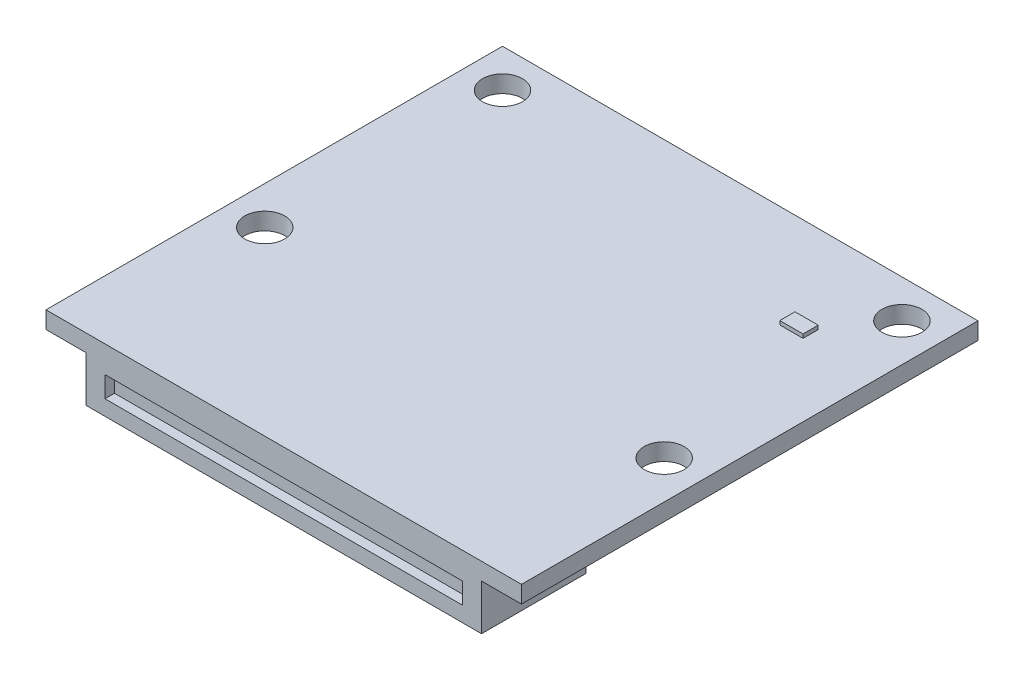
ISO-10303-21;
HEADER;
FILE_DESCRIPTION(('STEP AP214'),'2;1');
FILE_NAME('part.step','',(''),(''),'','','');
FILE_SCHEMA(('AUTOMOTIVE_DESIGN { 1 0 10303 214 1 1 1 1 }'));
ENDSEC;
DATA;
#1=APPLICATION_CONTEXT('core data for automotive mechanical design processes');
#2=APPLICATION_PROTOCOL_DEFINITION('international standard','automotive_design',2000,#1);
#3=PRODUCT_CONTEXT('',#1,'mechanical');
#4=PRODUCT('Part','Part','',(#3));
#5=PRODUCT_RELATED_PRODUCT_CATEGORY('part','',(#4));
#6=PRODUCT_DEFINITION_FORMATION('','',#4);
#7=PRODUCT_DEFINITION_CONTEXT('part definition',#1,'design');
#8=PRODUCT_DEFINITION('design','',#6,#7);
#9=PRODUCT_DEFINITION_SHAPE('','',#8);
#10=(LENGTH_UNIT() NAMED_UNIT(*) SI_UNIT(.MILLI.,.METRE.));
#11=(NAMED_UNIT(*) PLANE_ANGLE_UNIT() SI_UNIT($,.RADIAN.));
#12=(NAMED_UNIT(*) SI_UNIT($,.STERADIAN.) SOLID_ANGLE_UNIT());
#13=UNCERTAINTY_MEASURE_WITH_UNIT(LENGTH_MEASURE(1.E-05),#10,'distance_accuracy_value','');
#14=(GEOMETRIC_REPRESENTATION_CONTEXT(3) GLOBAL_UNCERTAINTY_ASSIGNED_CONTEXT((#13)) GLOBAL_UNIT_ASSIGNED_CONTEXT((#10,
#11,#12)) REPRESENTATION_CONTEXT('',''));
#15=CARTESIAN_POINT('',(0.,0.,0.));
#16=DIRECTION('',(0.,0.,1.));
#17=DIRECTION('',(1.,0.,0.));
#18=AXIS2_PLACEMENT_3D('',#15,#16,#17);
#19=CARTESIAN_POINT('',(0.,0.,0.));
#20=DIRECTION('',(0.,1.,0.));
#21=DIRECTION('',(0.,0.,1.));
#22=AXIS2_PLACEMENT_3D('',#19,#20,#21);
#23=PLANE('',#22);
#24=DIRECTION('',(0.,0.,1.));
#25=VECTOR('',#24,1.);
#26=CARTESIAN_POINT('',(-12.5,0.,-14.5));
#27=LINE('',#26,#25);
#28=CARTESIAN_POINT('',(-12.5,0.,-14.5));
#29=VERTEX_POINT('',#28);
#30=CARTESIAN_POINT('',(-12.5,0.,9.5));
#31=VERTEX_POINT('',#30);
#32=EDGE_CURVE('E321',#29,#31,#27,.T.);
#33=ORIENTED_EDGE('',*,*,#32,.T.);
#34=DIRECTION('',(1.,0.,0.));
#35=VECTOR('',#34,1.);
#36=CARTESIAN_POINT('',(-12.5,0.,9.5));
#37=LINE('',#36,#35);
#38=CARTESIAN_POINT('',(12.5,0.,9.5));
#39=VERTEX_POINT('',#38);
#40=EDGE_CURVE('E325',#31,#39,#37,.T.);
#41=ORIENTED_EDGE('',*,*,#40,.T.);
#42=DIRECTION('',(0.,0.,-1.));
#43=VECTOR('',#42,1.);
#44=CARTESIAN_POINT('',(12.5,0.,-14.5));
#45=LINE('',#44,#43);
#46=CARTESIAN_POINT('',(12.5,0.,-14.5));
#47=VERTEX_POINT('',#46);
#48=EDGE_CURVE('E330',#39,#47,#45,.T.);
#49=ORIENTED_EDGE('',*,*,#48,.T.);
#50=DIRECTION('',(-1.,0.,0.));
#51=VECTOR('',#50,1.);
#52=CARTESIAN_POINT('',(-12.5,0.,-14.5));
#53=LINE('',#52,#51);
#54=EDGE_CURVE('E334',#47,#29,#53,.T.);
#55=ORIENTED_EDGE('',*,*,#54,.T.);
#56=EDGE_LOOP('',(#33,#41,#49,#55));
#57=FACE_BOUND('',#56,.T.);
#58=CARTESIAN_POINT('',(10.5,0.,-12.5));
#59=DIRECTION('',(0.,1.,0.));
#60=DIRECTION('',(0.,0.,1.));
#61=AXIS2_PLACEMENT_3D('',#58,#59,#60);
#62=CIRCLE('',#61,1.05);
#63=CARTESIAN_POINT('',(10.5,0.,-11.45));
#64=VERTEX_POINT('',#63);
#65=EDGE_CURVE('E380',#64,#64,#62,.T.);
#66=ORIENTED_EDGE('',*,*,#65,.F.);
#67=EDGE_LOOP('',(#66));
#68=FACE_BOUND('',#67,.T.);
#69=CARTESIAN_POINT('',(10.5,0.,0.));
#70=DIRECTION('',(0.,1.,0.));
#71=DIRECTION('',(0.,0.,1.));
#72=AXIS2_PLACEMENT_3D('',#69,#70,#71);
#73=CIRCLE('',#72,1.05);
#74=CARTESIAN_POINT('',(10.5,0.,1.05));
#75=VERTEX_POINT('',#74);
#76=EDGE_CURVE('E391',#75,#75,#73,.T.);
#77=ORIENTED_EDGE('',*,*,#76,.F.);
#78=EDGE_LOOP('',(#77));
#79=FACE_BOUND('',#78,.T.);
#80=CARTESIAN_POINT('',(-10.5,0.,0.));
#81=DIRECTION('',(0.,1.,0.));
#82=DIRECTION('',(0.,0.,-1.));
#83=AXIS2_PLACEMENT_3D('',#80,#81,#82);
#84=CIRCLE('',#83,1.05);
#85=CARTESIAN_POINT('',(-10.5,0.,-1.05));
#86=VERTEX_POINT('',#85);
#87=EDGE_CURVE('E403',#86,#86,#84,.T.);
#88=ORIENTED_EDGE('',*,*,#87,.F.);
#89=EDGE_LOOP('',(#88));
#90=FACE_BOUND('',#89,.T.);
#91=CARTESIAN_POINT('',(-10.5,0.,-12.5));
#92=DIRECTION('',(0.,1.,0.));
#93=DIRECTION('',(0.,0.,-1.));
#94=AXIS2_PLACEMENT_3D('',#91,#92,#93);
#95=CIRCLE('',#94,1.05);
#96=CARTESIAN_POINT('',(-10.5,0.,-13.55));
#97=VERTEX_POINT('',#96);
#98=EDGE_CURVE('E415',#97,#97,#95,.T.);
#99=ORIENTED_EDGE('',*,*,#98,.F.);
#100=EDGE_LOOP('',(#99));
#101=FACE_BOUND('',#100,.T.);
#102=DIRECTION('',(-1.,0.,0.));
#103=VECTOR('',#102,1.);
#104=CARTESIAN_POINT('',(8.7,0.,-9.9));
#105=LINE('',#104,#103);
#106=CARTESIAN_POINT('',(8.7,0.,-9.9));
#107=VERTEX_POINT('',#106);
#108=CARTESIAN_POINT('',(7.48,0.,-9.9));
#109=VERTEX_POINT('',#108);
#110=EDGE_CURVE('E228',#107,#109,#105,.T.);
#111=ORIENTED_EDGE('',*,*,#110,.F.);
#112=DIRECTION('',(0.,0.,-1.));
#113=VECTOR('',#112,1.);
#114=CARTESIAN_POINT('',(8.7,0.,-9.1));
#115=LINE('',#114,#113);
#116=CARTESIAN_POINT('',(8.7,0.,-9.1));
#117=VERTEX_POINT('',#116);
#118=EDGE_CURVE('E204',#117,#107,#115,.T.);
#119=ORIENTED_EDGE('',*,*,#118,.F.);
#120=DIRECTION('',(1.,0.,0.));
#121=VECTOR('',#120,1.);
#122=CARTESIAN_POINT('',(8.7,0.,-9.1));
#123=LINE('',#122,#121);
#124=CARTESIAN_POINT('',(7.48,0.,-9.1));
#125=VERTEX_POINT('',#124);
#126=EDGE_CURVE('E215',#125,#117,#123,.T.);
#127=ORIENTED_EDGE('',*,*,#126,.F.);
#128=DIRECTION('',(0.,0.,1.));
#129=VECTOR('',#128,1.);
#130=CARTESIAN_POINT('',(7.48,0.,-9.1));
#131=LINE('',#130,#129);
#132=EDGE_CURVE('E231',#109,#125,#131,.T.);
#133=ORIENTED_EDGE('',*,*,#132,.F.);
#134=EDGE_LOOP('',(#111,#119,#127,#133));
#135=FACE_BOUND('',#134,.T.);
#136=ADVANCED_FACE('F42',(#57,#68,#79,#90,#101,#135),#23,.T.);
#137=CARTESIAN_POINT('',(0.,-0.9,0.));
#138=DIRECTION('',(0.,1.,0.));
#139=DIRECTION('',(0.,0.,1.));
#140=AXIS2_PLACEMENT_3D('',#137,#138,#139);
#141=PLANE('',#140);
#142=CARTESIAN_POINT('',(10.5,-0.9,-12.5));
#143=DIRECTION('',(0.,1.,0.));
#144=DIRECTION('',(0.,0.,1.));
#145=AXIS2_PLACEMENT_3D('',#142,#143,#144);
#146=CIRCLE('',#145,1.05);
#147=CARTESIAN_POINT('',(10.5,-0.9,-11.45));
#148=VERTEX_POINT('',#147);
#149=EDGE_CURVE('E326',#148,#148,#146,.T.);
#150=ORIENTED_EDGE('',*,*,#149,.T.);
#151=EDGE_LOOP('',(#150));
#152=FACE_BOUND('',#151,.T.);
#153=CARTESIAN_POINT('',(10.5,-0.9,0.));
#154=DIRECTION('',(0.,1.,0.));
#155=DIRECTION('',(0.,0.,1.));
#156=AXIS2_PLACEMENT_3D('',#153,#154,#155);
#157=CIRCLE('',#156,1.05);
#158=CARTESIAN_POINT('',(10.5,-0.9,1.05));
#159=VERTEX_POINT('',#158);
#160=EDGE_CURVE('E386',#159,#159,#157,.T.);
#161=ORIENTED_EDGE('',*,*,#160,.T.);
#162=EDGE_LOOP('',(#161));
#163=FACE_BOUND('',#162,.T.);
#164=CARTESIAN_POINT('',(-10.5,-0.9,0.));
#165=DIRECTION('',(0.,1.,0.));
#166=DIRECTION('',(0.,0.,-1.));
#167=AXIS2_PLACEMENT_3D('',#164,#165,#166);
#168=CIRCLE('',#167,1.05);
#169=CARTESIAN_POINT('',(-10.5,-0.9,-1.05));
#170=VERTEX_POINT('',#169);
#171=EDGE_CURVE('E397',#170,#170,#168,.T.);
#172=ORIENTED_EDGE('',*,*,#171,.T.);
#173=EDGE_LOOP('',(#172));
#174=FACE_BOUND('',#173,.T.);
#175=CARTESIAN_POINT('',(-10.5,-0.9,-12.5));
#176=DIRECTION('',(0.,1.,0.));
#177=DIRECTION('',(0.,0.,-1.));
#178=AXIS2_PLACEMENT_3D('',#175,#176,#177);
#179=CIRCLE('',#178,1.05);
#180=CARTESIAN_POINT('',(-10.5,-0.9,-13.55));
#181=VERTEX_POINT('',#180);
#182=EDGE_CURVE('E409',#181,#181,#179,.T.);
#183=ORIENTED_EDGE('',*,*,#182,.T.);
#184=EDGE_LOOP('',(#183));
#185=FACE_BOUND('',#184,.T.);
#186=DIRECTION('',(0.,0.,-1.));
#187=VECTOR('',#186,1.);
#188=CARTESIAN_POINT('',(-10.4,-0.9,9.5));
#189=LINE('',#188,#187);
#190=CARTESIAN_POINT('',(-10.4,-0.9,9.5));
#191=VERTEX_POINT('',#190);
#192=CARTESIAN_POINT('',(-10.4,-0.9,4.));
#193=VERTEX_POINT('',#192);
#194=EDGE_CURVE('E248',#191,#193,#189,.T.);
#195=ORIENTED_EDGE('',*,*,#194,.F.);
#196=DIRECTION('',(1.,0.,0.));
#197=VECTOR('',#196,1.);
#198=CARTESIAN_POINT('',(-12.5,-0.9,9.5));
#199=LINE('',#198,#197);
#200=CARTESIAN_POINT('',(-12.5,-0.9,9.5));
#201=VERTEX_POINT('',#200);
#202=EDGE_CURVE('E304',#201,#191,#199,.T.);
#203=ORIENTED_EDGE('',*,*,#202,.F.);
#204=DIRECTION('',(0.,0.,1.));
#205=VECTOR('',#204,1.);
#206=CARTESIAN_POINT('',(-12.5,-0.9,-14.5));
#207=LINE('',#206,#205);
#208=CARTESIAN_POINT('',(-12.5,-0.9,-14.5));
#209=VERTEX_POINT('',#208);
#210=EDGE_CURVE('E305',#209,#201,#207,.T.);
#211=ORIENTED_EDGE('',*,*,#210,.F.);
#212=DIRECTION('',(-1.,0.,0.));
#213=VECTOR('',#212,1.);
#214=CARTESIAN_POINT('',(-12.5,-0.9,-14.5));
#215=LINE('',#214,#213);
#216=CARTESIAN_POINT('',(12.5,-0.9,-14.5));
#217=VERTEX_POINT('',#216);
#218=EDGE_CURVE('E316',#217,#209,#215,.T.);
#219=ORIENTED_EDGE('',*,*,#218,.F.);
#220=DIRECTION('',(0.,0.,-1.));
#221=VECTOR('',#220,1.);
#222=CARTESIAN_POINT('',(12.5,-0.9,-14.5));
#223=LINE('',#222,#221);
#224=CARTESIAN_POINT('',(12.5,-0.9,9.5));
#225=VERTEX_POINT('',#224);
#226=EDGE_CURVE('E311',#225,#217,#223,.T.);
#227=ORIENTED_EDGE('',*,*,#226,.F.);
#228=CARTESIAN_POINT('',(10.4,-0.9,9.5));
#229=VERTEX_POINT('',#228);
#230=EDGE_CURVE('E300',#229,#225,#199,.T.);
#231=ORIENTED_EDGE('',*,*,#230,.F.);
#232=DIRECTION('',(0.,0.,1.));
#233=VECTOR('',#232,1.);
#234=CARTESIAN_POINT('',(10.4,-0.9,9.5));
#235=LINE('',#234,#233);
#236=CARTESIAN_POINT('',(10.4,-0.9,4.));
#237=VERTEX_POINT('',#236);
#238=EDGE_CURVE('E254',#237,#229,#235,.T.);
#239=ORIENTED_EDGE('',*,*,#238,.F.);
#240=DIRECTION('',(1.,0.,0.));
#241=VECTOR('',#240,1.);
#242=CARTESIAN_POINT('',(-10.4,-0.9,4.));
#243=LINE('',#242,#241);
#244=EDGE_CURVE('E264',#193,#237,#243,.T.);
#245=ORIENTED_EDGE('',*,*,#244,.F.);
#246=EDGE_LOOP('',(#195,#203,#211,#219,#227,#231,#239,#245));
#247=FACE_BOUND('',#246,.T.);
#248=ADVANCED_FACE('F361',(#152,#163,#174,#185,#247),#141,.F.);
#249=CARTESIAN_POINT('',(-12.5,-0.9,-14.5));
#250=DIRECTION('',(-1.,0.,0.));
#251=DIRECTION('',(0.,0.,1.));
#252=AXIS2_PLACEMENT_3D('',#249,#250,#251);
#253=PLANE('',#252);
#254=ORIENTED_EDGE('',*,*,#32,.F.);
#255=DIRECTION('',(0.,1.,0.));
#256=VECTOR('',#255,1.);
#257=CARTESIAN_POINT('',(-12.5,-0.9,-14.5));
#258=LINE('',#257,#256);
#259=EDGE_CURVE('E11',#209,#29,#258,.T.);
#260=ORIENTED_EDGE('',*,*,#259,.F.);
#261=ORIENTED_EDGE('',*,*,#210,.T.);
#262=DIRECTION('',(0.,1.,0.));
#263=VECTOR('',#262,1.);
#264=CARTESIAN_POINT('',(-12.5,-0.9,9.5));
#265=LINE('',#264,#263);
#266=EDGE_CURVE('E320',#201,#31,#265,.T.);
#267=ORIENTED_EDGE('',*,*,#266,.T.);
#268=EDGE_LOOP('',(#254,#260,#261,#267));
#269=FACE_BOUND('',#268,.T.);
#270=ADVANCED_FACE('F44',(#269),#253,.T.);
#271=CARTESIAN_POINT('',(-12.5,-0.9,-14.5));
#272=DIRECTION('',(0.,0.,-1.));
#273=DIRECTION('',(-1.,0.,0.));
#274=AXIS2_PLACEMENT_3D('',#271,#272,#273);
#275=PLANE('',#274);
#276=ORIENTED_EDGE('',*,*,#54,.F.);
#277=DIRECTION('',(0.,1.,0.));
#278=VECTOR('',#277,1.);
#279=CARTESIAN_POINT('',(12.5,-0.9,-14.5));
#280=LINE('',#279,#278);
#281=EDGE_CURVE('E52',#217,#47,#280,.T.);
#282=ORIENTED_EDGE('',*,*,#281,.F.);
#283=ORIENTED_EDGE('',*,*,#218,.T.);
#284=ORIENTED_EDGE('',*,*,#259,.T.);
#285=EDGE_LOOP('',(#276,#282,#283,#284));
#286=FACE_BOUND('',#285,.T.);
#287=ADVANCED_FACE('F358',(#286),#275,.T.);
#288=CARTESIAN_POINT('',(12.5,-0.9,-14.5));
#289=DIRECTION('',(1.,0.,0.));
#290=DIRECTION('',(0.,0.,-1.));
#291=AXIS2_PLACEMENT_3D('',#288,#289,#290);
#292=PLANE('',#291);
#293=ORIENTED_EDGE('',*,*,#48,.F.);
#294=DIRECTION('',(0.,1.,0.));
#295=VECTOR('',#294,1.);
#296=CARTESIAN_POINT('',(12.5,-0.9,9.5));
#297=LINE('',#296,#295);
#298=EDGE_CURVE('E340',#225,#39,#297,.T.);
#299=ORIENTED_EDGE('',*,*,#298,.F.);
#300=ORIENTED_EDGE('',*,*,#226,.T.);
#301=ORIENTED_EDGE('',*,*,#281,.T.);
#302=EDGE_LOOP('',(#293,#299,#300,#301));
#303=FACE_BOUND('',#302,.T.);
#304=ADVANCED_FACE('F691',(#303),#292,.T.);
#305=CARTESIAN_POINT('',(-12.5,-0.9,9.5));
#306=DIRECTION('',(0.,0.,1.));
#307=DIRECTION('',(1.,0.,0.));
#308=AXIS2_PLACEMENT_3D('',#305,#306,#307);
#309=PLANE('',#308);
#310=DIRECTION('',(0.,-1.,0.));
#311=VECTOR('',#310,1.);
#312=CARTESIAN_POINT('',(-9.4,-1.4,9.5));
#313=LINE('',#312,#311);
#314=CARTESIAN_POINT('',(-9.4,-1.4,9.5));
#315=VERTEX_POINT('',#314);
#316=CARTESIAN_POINT('',(-9.4,-2.5,9.5));
#317=VERTEX_POINT('',#316);
#318=EDGE_CURVE('E60',#315,#317,#313,.T.);
#319=ORIENTED_EDGE('',*,*,#318,.F.);
#320=DIRECTION('',(-1.,0.,0.));
#321=VECTOR('',#320,1.);
#322=CARTESIAN_POINT('',(-9.4,-1.4,9.5));
#323=LINE('',#322,#321);
#324=CARTESIAN_POINT('',(9.4,-1.4,9.5));
#325=VERTEX_POINT('',#324);
#326=EDGE_CURVE('E181',#325,#315,#323,.T.);
#327=ORIENTED_EDGE('',*,*,#326,.F.);
#328=DIRECTION('',(0.,1.,0.));
#329=VECTOR('',#328,1.);
#330=CARTESIAN_POINT('',(9.4,-1.4,9.5));
#331=LINE('',#330,#329);
#332=CARTESIAN_POINT('',(9.4,-2.5,9.5));
#333=VERTEX_POINT('',#332);
#334=EDGE_CURVE('E186',#333,#325,#331,.T.);
#335=ORIENTED_EDGE('',*,*,#334,.F.);
#336=DIRECTION('',(1.,0.,0.));
#337=VECTOR('',#336,1.);
#338=CARTESIAN_POINT('',(-9.4,-2.5,9.5));
#339=LINE('',#338,#337);
#340=EDGE_CURVE('E195',#317,#333,#339,.T.);
#341=ORIENTED_EDGE('',*,*,#340,.F.);
#342=EDGE_LOOP('',(#319,#327,#335,#341));
#343=FACE_BOUND('',#342,.T.);
#344=ORIENTED_EDGE('',*,*,#40,.F.);
#345=ORIENTED_EDGE('',*,*,#266,.F.);
#346=ORIENTED_EDGE('',*,*,#202,.T.);
#347=DIRECTION('',(0.,1.,0.));
#348=VECTOR('',#347,1.);
#349=CARTESIAN_POINT('',(-10.4,-3.3,9.5));
#350=LINE('',#349,#348);
#351=CARTESIAN_POINT('',(-10.4,-3.3,9.5));
#352=VERTEX_POINT('',#351);
#353=EDGE_CURVE('E263',#352,#191,#350,.T.);
#354=ORIENTED_EDGE('',*,*,#353,.F.);
#355=DIRECTION('',(-1.,0.,0.));
#356=VECTOR('',#355,1.);
#357=CARTESIAN_POINT('',(-10.4,-3.3,9.5));
#358=LINE('',#357,#356);
#359=CARTESIAN_POINT('',(10.4,-3.3,9.5));
#360=VERTEX_POINT('',#359);
#361=EDGE_CURVE('E260',#360,#352,#358,.T.);
#362=ORIENTED_EDGE('',*,*,#361,.F.);
#363=DIRECTION('',(0.,1.,0.));
#364=VECTOR('',#363,1.);
#365=CARTESIAN_POINT('',(10.4,-3.3,9.5));
#366=LINE('',#365,#364);
#367=EDGE_CURVE('E278',#360,#229,#366,.T.);
#368=ORIENTED_EDGE('',*,*,#367,.T.);
#369=ORIENTED_EDGE('',*,*,#230,.T.);
#370=ORIENTED_EDGE('',*,*,#298,.T.);
#371=EDGE_LOOP('',(#344,#345,#346,#354,#362,#368,#369,#370));
#372=FACE_BOUND('',#371,.T.);
#373=ADVANCED_FACE('F351',(#343,#372),#309,.T.);
#374=CARTESIAN_POINT('',(10.5,-0.9,-12.5));
#375=DIRECTION('',(0.,1.,0.));
#376=DIRECTION('',(0.,0.,1.));
#377=AXIS2_PLACEMENT_3D('',#374,#375,#376);
#378=CYLINDRICAL_SURFACE('',#377,1.05);
#379=ORIENTED_EDGE('',*,*,#149,.F.);
#380=EDGE_LOOP('',(#379));
#381=FACE_BOUND('',#380,.T.);
#382=ORIENTED_EDGE('',*,*,#65,.T.);
#383=EDGE_LOOP('',(#382));
#384=FACE_BOUND('',#383,.T.);
#385=ADVANCED_FACE('F673',(#381,#384),#378,.F.);
#386=CARTESIAN_POINT('',(10.5,-0.9,0.));
#387=DIRECTION('',(0.,1.,0.));
#388=DIRECTION('',(0.,0.,1.));
#389=AXIS2_PLACEMENT_3D('',#386,#387,#388);
#390=CYLINDRICAL_SURFACE('',#389,1.05);
#391=ORIENTED_EDGE('',*,*,#160,.F.);
#392=EDGE_LOOP('',(#391));
#393=FACE_BOUND('',#392,.T.);
#394=ORIENTED_EDGE('',*,*,#76,.T.);
#395=EDGE_LOOP('',(#394));
#396=FACE_BOUND('',#395,.T.);
#397=ADVANCED_FACE('F662',(#393,#396),#390,.F.);
#398=CARTESIAN_POINT('',(-10.5,-0.9,0.));
#399=DIRECTION('',(0.,1.,0.));
#400=DIRECTION('',(0.,0.,1.));
#401=AXIS2_PLACEMENT_3D('',#398,#399,#400);
#402=CYLINDRICAL_SURFACE('',#401,1.05);
#403=ORIENTED_EDGE('',*,*,#171,.F.);
#404=EDGE_LOOP('',(#403));
#405=FACE_BOUND('',#404,.T.);
#406=ORIENTED_EDGE('',*,*,#87,.T.);
#407=EDGE_LOOP('',(#406));
#408=FACE_BOUND('',#407,.T.);
#409=ADVANCED_FACE('F651',(#405,#408),#402,.F.);
#410=CARTESIAN_POINT('',(-10.5,-0.9,-12.5));
#411=DIRECTION('',(0.,1.,0.));
#412=DIRECTION('',(0.,0.,1.));
#413=AXIS2_PLACEMENT_3D('',#410,#411,#412);
#414=CYLINDRICAL_SURFACE('',#413,1.05);
#415=ORIENTED_EDGE('',*,*,#182,.F.);
#416=EDGE_LOOP('',(#415));
#417=FACE_BOUND('',#416,.T.);
#418=ORIENTED_EDGE('',*,*,#98,.T.);
#419=EDGE_LOOP('',(#418));
#420=FACE_BOUND('',#419,.T.);
#421=ADVANCED_FACE('F642',(#417,#420),#414,.F.);
#422=CARTESIAN_POINT('',(-10.4,-3.3,9.5));
#423=DIRECTION('',(1.,0.,0.));
#424=DIRECTION('',(0.,0.,-1.));
#425=AXIS2_PLACEMENT_3D('',#422,#423,#424);
#426=PLANE('',#425);
#427=ORIENTED_EDGE('',*,*,#194,.T.);
#428=DIRECTION('',(0.,1.,0.));
#429=VECTOR('',#428,1.);
#430=CARTESIAN_POINT('',(-10.4,-3.3,4.));
#431=LINE('',#430,#429);
#432=CARTESIAN_POINT('',(-10.4,-3.3,4.));
#433=VERTEX_POINT('',#432);
#434=EDGE_CURVE('E288',#433,#193,#431,.T.);
#435=ORIENTED_EDGE('',*,*,#434,.F.);
#436=DIRECTION('',(0.,0.,-1.));
#437=VECTOR('',#436,1.);
#438=CARTESIAN_POINT('',(-10.4,-3.3,9.5));
#439=LINE('',#438,#437);
#440=EDGE_CURVE('E249',#352,#433,#439,.T.);
#441=ORIENTED_EDGE('',*,*,#440,.F.);
#442=ORIENTED_EDGE('',*,*,#353,.T.);
#443=EDGE_LOOP('',(#427,#435,#441,#442));
#444=FACE_BOUND('',#443,.T.);
#445=ADVANCED_FACE('F495',(#444),#426,.F.);
#446=CARTESIAN_POINT('',(-10.4,-3.3,4.));
#447=DIRECTION('',(0.,0.,1.));
#448=DIRECTION('',(1.,0.,0.));
#449=AXIS2_PLACEMENT_3D('',#446,#447,#448);
#450=PLANE('',#449);
#451=ORIENTED_EDGE('',*,*,#244,.T.);
#452=DIRECTION('',(0.,1.,0.));
#453=VECTOR('',#452,1.);
#454=CARTESIAN_POINT('',(10.4,-3.3,4.));
#455=LINE('',#454,#453);
#456=CARTESIAN_POINT('',(10.4,-3.3,4.));
#457=VERTEX_POINT('',#456);
#458=EDGE_CURVE('E270',#457,#237,#455,.T.);
#459=ORIENTED_EDGE('',*,*,#458,.F.);
#460=DIRECTION('',(1.,0.,0.));
#461=VECTOR('',#460,1.);
#462=CARTESIAN_POINT('',(-10.4,-3.3,4.));
#463=LINE('',#462,#461);
#464=EDGE_CURVE('E253',#433,#457,#463,.T.);
#465=ORIENTED_EDGE('',*,*,#464,.F.);
#466=ORIENTED_EDGE('',*,*,#434,.T.);
#467=EDGE_LOOP('',(#451,#459,#465,#466));
#468=FACE_BOUND('',#467,.T.);
#469=ADVANCED_FACE('F493',(#468),#450,.F.);
#470=CARTESIAN_POINT('',(10.4,-3.3,9.5));
#471=DIRECTION('',(-1.,0.,0.));
#472=DIRECTION('',(0.,0.,1.));
#473=AXIS2_PLACEMENT_3D('',#470,#471,#472);
#474=PLANE('',#473);
#475=ORIENTED_EDGE('',*,*,#238,.T.);
#476=ORIENTED_EDGE('',*,*,#367,.F.);
#477=DIRECTION('',(0.,0.,1.));
#478=VECTOR('',#477,1.);
#479=CARTESIAN_POINT('',(10.4,-3.3,9.5));
#480=LINE('',#479,#478);
#481=EDGE_CURVE('E257',#457,#360,#480,.T.);
#482=ORIENTED_EDGE('',*,*,#481,.F.);
#483=ORIENTED_EDGE('',*,*,#458,.T.);
#484=EDGE_LOOP('',(#475,#476,#482,#483));
#485=FACE_BOUND('',#484,.T.);
#486=ADVANCED_FACE('F613',(#485),#474,.F.);
#487=CARTESIAN_POINT('',(0.,-3.3,0.));
#488=DIRECTION('',(0.,-1.,0.));
#489=DIRECTION('',(0.,0.,-1.));
#490=AXIS2_PLACEMENT_3D('',#487,#488,#489);
#491=PLANE('',#490);
#492=ORIENTED_EDGE('',*,*,#440,.T.);
#493=ORIENTED_EDGE('',*,*,#464,.T.);
#494=ORIENTED_EDGE('',*,*,#481,.T.);
#495=ORIENTED_EDGE('',*,*,#361,.T.);
#496=EDGE_LOOP('',(#492,#493,#494,#495));
#497=FACE_BOUND('',#496,.T.);
#498=ADVANCED_FACE('F602',(#497),#491,.T.);
#499=CARTESIAN_POINT('',(8.7,0.2,-9.1));
#500=DIRECTION('',(-1.,0.,0.));
#501=DIRECTION('',(0.,0.,1.));
#502=AXIS2_PLACEMENT_3D('',#499,#500,#501);
#503=PLANE('',#502);
#504=ORIENTED_EDGE('',*,*,#118,.T.);
#505=DIRECTION('',(0.,-1.,0.));
#506=VECTOR('',#505,1.);
#507=CARTESIAN_POINT('',(8.7,0.2,-9.9));
#508=LINE('',#507,#506);
#509=CARTESIAN_POINT('',(8.7,0.2,-9.9));
#510=VERTEX_POINT('',#509);
#511=EDGE_CURVE('E245',#510,#107,#508,.T.);
#512=ORIENTED_EDGE('',*,*,#511,.F.);
#513=DIRECTION('',(0.,0.,-1.));
#514=VECTOR('',#513,1.);
#515=CARTESIAN_POINT('',(8.7,0.2,-9.1));
#516=LINE('',#515,#514);
#517=CARTESIAN_POINT('',(8.7,0.2,-9.1));
#518=VERTEX_POINT('',#517);
#519=EDGE_CURVE('E210',#518,#510,#516,.T.);
#520=ORIENTED_EDGE('',*,*,#519,.F.);
#521=DIRECTION('',(0.,-1.,0.));
#522=VECTOR('',#521,1.);
#523=CARTESIAN_POINT('',(8.7,0.2,-9.1));
#524=LINE('',#523,#522);
#525=EDGE_CURVE('E224',#518,#117,#524,.T.);
#526=ORIENTED_EDGE('',*,*,#525,.T.);
#527=EDGE_LOOP('',(#504,#512,#520,#526));
#528=FACE_BOUND('',#527,.T.);
#529=ADVANCED_FACE('F592',(#528),#503,.F.);
#530=CARTESIAN_POINT('',(8.7,0.2,-9.9));
#531=DIRECTION('',(0.,0.,1.));
#532=DIRECTION('',(1.,0.,0.));
#533=AXIS2_PLACEMENT_3D('',#530,#531,#532);
#534=PLANE('',#533);
#535=ORIENTED_EDGE('',*,*,#110,.T.);
#536=DIRECTION('',(0.,-1.,0.));
#537=VECTOR('',#536,1.);
#538=CARTESIAN_POINT('',(7.48,0.2,-9.9));
#539=LINE('',#538,#537);
#540=CARTESIAN_POINT('',(7.48,0.2,-9.9));
#541=VERTEX_POINT('',#540);
#542=EDGE_CURVE('E241',#541,#109,#539,.T.);
#543=ORIENTED_EDGE('',*,*,#542,.F.);
#544=DIRECTION('',(-1.,0.,0.));
#545=VECTOR('',#544,1.);
#546=CARTESIAN_POINT('',(8.7,0.2,-9.9));
#547=LINE('',#546,#545);
#548=EDGE_CURVE('E214',#510,#541,#547,.T.);
#549=ORIENTED_EDGE('',*,*,#548,.F.);
#550=ORIENTED_EDGE('',*,*,#511,.T.);
#551=EDGE_LOOP('',(#535,#543,#549,#550));
#552=FACE_BOUND('',#551,.T.);
#553=ADVANCED_FACE('F582',(#552),#534,.F.);
#554=CARTESIAN_POINT('',(7.48,0.2,-9.1));
#555=DIRECTION('',(1.,0.,0.));
#556=DIRECTION('',(0.,0.,-1.));
#557=AXIS2_PLACEMENT_3D('',#554,#555,#556);
#558=PLANE('',#557);
#559=ORIENTED_EDGE('',*,*,#132,.T.);
#560=DIRECTION('',(0.,-1.,0.));
#561=VECTOR('',#560,1.);
#562=CARTESIAN_POINT('',(7.48,0.2,-9.1));
#563=LINE('',#562,#561);
#564=CARTESIAN_POINT('',(7.48,0.2,-9.1));
#565=VERTEX_POINT('',#564);
#566=EDGE_CURVE('E68',#565,#125,#563,.T.);
#567=ORIENTED_EDGE('',*,*,#566,.F.);
#568=DIRECTION('',(0.,0.,1.));
#569=VECTOR('',#568,1.);
#570=CARTESIAN_POINT('',(7.48,0.2,-9.1));
#571=LINE('',#570,#569);
#572=EDGE_CURVE('E218',#541,#565,#571,.T.);
#573=ORIENTED_EDGE('',*,*,#572,.F.);
#574=ORIENTED_EDGE('',*,*,#542,.T.);
#575=EDGE_LOOP('',(#559,#567,#573,#574));
#576=FACE_BOUND('',#575,.T.);
#577=ADVANCED_FACE('F573',(#576),#558,.F.);
#578=CARTESIAN_POINT('',(8.7,0.2,-9.1));
#579=DIRECTION('',(0.,0.,-1.));
#580=DIRECTION('',(-1.,0.,0.));
#581=AXIS2_PLACEMENT_3D('',#578,#579,#580);
#582=PLANE('',#581);
#583=ORIENTED_EDGE('',*,*,#126,.T.);
#584=ORIENTED_EDGE('',*,*,#525,.F.);
#585=DIRECTION('',(1.,0.,0.));
#586=VECTOR('',#585,1.);
#587=CARTESIAN_POINT('',(8.7,0.2,-9.1));
#588=LINE('',#587,#586);
#589=EDGE_CURVE('E221',#565,#518,#588,.T.);
#590=ORIENTED_EDGE('',*,*,#589,.F.);
#591=ORIENTED_EDGE('',*,*,#566,.T.);
#592=EDGE_LOOP('',(#583,#584,#590,#591));
#593=FACE_BOUND('',#592,.T.);
#594=ADVANCED_FACE('F561',(#593),#582,.F.);
#595=CARTESIAN_POINT('',(0.,0.2,0.));
#596=DIRECTION('',(0.,1.,0.));
#597=DIRECTION('',(0.,0.,1.));
#598=AXIS2_PLACEMENT_3D('',#595,#596,#597);
#599=PLANE('',#598);
#600=ORIENTED_EDGE('',*,*,#519,.T.);
#601=ORIENTED_EDGE('',*,*,#548,.T.);
#602=ORIENTED_EDGE('',*,*,#572,.T.);
#603=ORIENTED_EDGE('',*,*,#589,.T.);
#604=EDGE_LOOP('',(#600,#601,#602,#603));
#605=FACE_BOUND('',#604,.T.);
#606=ADVANCED_FACE('F551',(#605),#599,.T.);
#607=CARTESIAN_POINT('',(-9.4,-1.4,9.));
#608=DIRECTION('',(-1.,0.,0.));
#609=DIRECTION('',(0.,0.,1.));
#610=AXIS2_PLACEMENT_3D('',#607,#608,#609);
#611=PLANE('',#610);
#612=ORIENTED_EDGE('',*,*,#318,.T.);
#613=DIRECTION('',(0.,0.,1.));
#614=VECTOR('',#613,1.);
#615=CARTESIAN_POINT('',(-9.4,-2.5,9.));
#616=LINE('',#615,#614);
#617=CARTESIAN_POINT('',(-9.4,-2.5,9.));
#618=VERTEX_POINT('',#617);
#619=EDGE_CURVE('E156',#618,#317,#616,.T.);
#620=ORIENTED_EDGE('',*,*,#619,.F.);
#621=DIRECTION('',(0.,-1.,0.));
#622=VECTOR('',#621,1.);
#623=CARTESIAN_POINT('',(-9.4,-1.4,9.));
#624=LINE('',#623,#622);
#625=CARTESIAN_POINT('',(-9.4,-1.4,9.));
#626=VERTEX_POINT('',#625);
#627=EDGE_CURVE('E160',#626,#618,#624,.T.);
#628=ORIENTED_EDGE('',*,*,#627,.F.);
#629=DIRECTION('',(0.,0.,1.));
#630=VECTOR('',#629,1.);
#631=CARTESIAN_POINT('',(-9.4,-1.4,9.));
#632=LINE('',#631,#630);
#633=EDGE_CURVE('E201',#626,#315,#632,.T.);
#634=ORIENTED_EDGE('',*,*,#633,.T.);
#635=EDGE_LOOP('',(#612,#620,#628,#634));
#636=FACE_BOUND('',#635,.T.);
#637=ADVANCED_FACE('F158',(#636),#611,.F.);
#638=CARTESIAN_POINT('',(-9.4,-1.4,9.));
#639=DIRECTION('',(0.,1.,0.));
#640=DIRECTION('',(0.,0.,1.));
#641=AXIS2_PLACEMENT_3D('',#638,#639,#640);
#642=PLANE('',#641);
#643=ORIENTED_EDGE('',*,*,#326,.T.);
#644=ORIENTED_EDGE('',*,*,#633,.F.);
#645=DIRECTION('',(-1.,0.,0.));
#646=VECTOR('',#645,1.);
#647=CARTESIAN_POINT('',(-9.4,-1.4,9.));
#648=LINE('',#647,#646);
#649=CARTESIAN_POINT('',(9.4,-1.4,9.));
#650=VERTEX_POINT('',#649);
#651=EDGE_CURVE('E167',#650,#626,#648,.T.);
#652=ORIENTED_EDGE('',*,*,#651,.F.);
#653=DIRECTION('',(0.,0.,1.));
#654=VECTOR('',#653,1.);
#655=CARTESIAN_POINT('',(9.4,-1.4,9.));
#656=LINE('',#655,#654);
#657=EDGE_CURVE('E205',#650,#325,#656,.T.);
#658=ORIENTED_EDGE('',*,*,#657,.T.);
#659=EDGE_LOOP('',(#643,#644,#652,#658));
#660=FACE_BOUND('',#659,.T.);
#661=ADVANCED_FACE('F532',(#660),#642,.F.);
#662=CARTESIAN_POINT('',(9.4,-1.4,9.));
#663=DIRECTION('',(1.,0.,0.));
#664=DIRECTION('',(0.,0.,-1.));
#665=AXIS2_PLACEMENT_3D('',#662,#663,#664);
#666=PLANE('',#665);
#667=ORIENTED_EDGE('',*,*,#334,.T.);
#668=ORIENTED_EDGE('',*,*,#657,.F.);
#669=DIRECTION('',(0.,1.,0.));
#670=VECTOR('',#669,1.);
#671=CARTESIAN_POINT('',(9.4,-1.4,9.));
#672=LINE('',#671,#670);
#673=CARTESIAN_POINT('',(9.4,-2.5,9.));
#674=VERTEX_POINT('',#673);
#675=EDGE_CURVE('E176',#674,#650,#672,.T.);
#676=ORIENTED_EDGE('',*,*,#675,.F.);
#677=DIRECTION('',(0.,0.,1.));
#678=VECTOR('',#677,1.);
#679=CARTESIAN_POINT('',(9.4,-2.5,9.));
#680=LINE('',#679,#678);
#681=EDGE_CURVE('E166',#674,#333,#680,.T.);
#682=ORIENTED_EDGE('',*,*,#681,.T.);
#683=EDGE_LOOP('',(#667,#668,#676,#682));
#684=FACE_BOUND('',#683,.T.);
#685=ADVANCED_FACE('F523',(#684),#666,.F.);
#686=CARTESIAN_POINT('',(-9.4,-2.5,9.));
#687=DIRECTION('',(0.,-1.,0.));
#688=DIRECTION('',(0.,0.,-1.));
#689=AXIS2_PLACEMENT_3D('',#686,#687,#688);
#690=PLANE('',#689);
#691=ORIENTED_EDGE('',*,*,#340,.T.);
#692=ORIENTED_EDGE('',*,*,#681,.F.);
#693=DIRECTION('',(1.,0.,0.));
#694=VECTOR('',#693,1.);
#695=CARTESIAN_POINT('',(-9.4,-2.5,9.));
#696=LINE('',#695,#694);
#697=EDGE_CURVE('E170',#618,#674,#696,.T.);
#698=ORIENTED_EDGE('',*,*,#697,.F.);
#699=ORIENTED_EDGE('',*,*,#619,.T.);
#700=EDGE_LOOP('',(#691,#692,#698,#699));
#701=FACE_BOUND('',#700,.T.);
#702=ADVANCED_FACE('F171',(#701),#690,.F.);
#703=CARTESIAN_POINT('',(0.,0.,9.));
#704=DIRECTION('',(0.,0.,1.));
#705=DIRECTION('',(1.,0.,0.));
#706=AXIS2_PLACEMENT_3D('',#703,#704,#705);
#707=PLANE('',#706);
#708=ORIENTED_EDGE('',*,*,#627,.T.);
#709=ORIENTED_EDGE('',*,*,#697,.T.);
#710=ORIENTED_EDGE('',*,*,#675,.T.);
#711=ORIENTED_EDGE('',*,*,#651,.T.);
#712=EDGE_LOOP('',(#708,#709,#710,#711));
#713=FACE_BOUND('',#712,.T.);
#714=ADVANCED_FACE('F178',(#713),#707,.T.);
#715=CLOSED_SHELL('',(#136,#248,#270,#287,#304,#373,#385,#397,#409,#421,#445,#469,#486,#498,
#529,#553,#577,#594,#606,#637,#661,#685,#702,#714));
#716=MANIFOLD_SOLID_BREP('B2',#715);
#717=ADVANCED_BREP_SHAPE_REPRESENTATION('',(#18,#716),#14);
#718=SHAPE_DEFINITION_REPRESENTATION(#9,#717);
ENDSEC;
END-ISO-10303-21;
